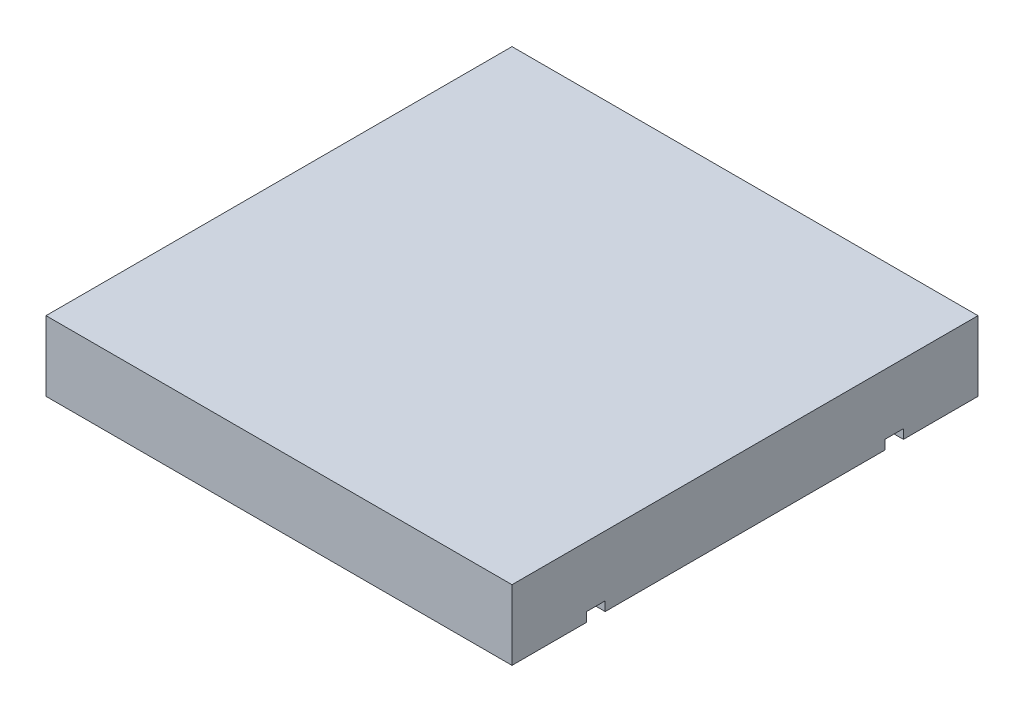
ISO-10303-21;
HEADER;
FILE_DESCRIPTION(('STEP AP214'),'2;1');
FILE_NAME('part.step','',(''),(''),'','','');
FILE_SCHEMA(('AUTOMOTIVE_DESIGN { 1 0 10303 214 1 1 1 1 }'));
ENDSEC;
DATA;
#1=APPLICATION_CONTEXT('core data for automotive mechanical design processes');
#2=APPLICATION_PROTOCOL_DEFINITION('international standard','automotive_design',2000,#1);
#3=PRODUCT_CONTEXT('',#1,'mechanical');
#4=PRODUCT('Part','Part','',(#3));
#5=PRODUCT_RELATED_PRODUCT_CATEGORY('part','',(#4));
#6=PRODUCT_DEFINITION_FORMATION('','',#4);
#7=PRODUCT_DEFINITION_CONTEXT('part definition',#1,'design');
#8=PRODUCT_DEFINITION('design','',#6,#7);
#9=PRODUCT_DEFINITION_SHAPE('','',#8);
#10=(LENGTH_UNIT() NAMED_UNIT(*) SI_UNIT(.MILLI.,.METRE.));
#11=(NAMED_UNIT(*) PLANE_ANGLE_UNIT() SI_UNIT($,.RADIAN.));
#12=(NAMED_UNIT(*) SI_UNIT($,.STERADIAN.) SOLID_ANGLE_UNIT());
#13=UNCERTAINTY_MEASURE_WITH_UNIT(LENGTH_MEASURE(1.E-05),#10,'distance_accuracy_value','');
#14=(GEOMETRIC_REPRESENTATION_CONTEXT(3) GLOBAL_UNCERTAINTY_ASSIGNED_CONTEXT((#13)) GLOBAL_UNIT_ASSIGNED_CONTEXT((#10,
#11,#12)) REPRESENTATION_CONTEXT('',''));
#15=CARTESIAN_POINT('',(0.,0.,0.));
#16=DIRECTION('',(0.,0.,1.));
#17=DIRECTION('',(1.,0.,0.));
#18=AXIS2_PLACEMENT_3D('',#15,#16,#17);
#19=CARTESIAN_POINT('',(0.,0.,0.));
#20=DIRECTION('',(0.,-1.,0.));
#21=DIRECTION('',(0.,0.,-1.));
#22=AXIS2_PLACEMENT_3D('',#19,#20,#21);
#23=PLANE('',#22);
#24=DIRECTION('',(-1.,0.,0.));
#25=VECTOR('',#24,1.);
#26=CARTESIAN_POINT('',(0.,0.,-300.));
#27=LINE('',#26,#25);
#28=CARTESIAN_POINT('',(500.,0.,-300.));
#29=VERTEX_POINT('',#28);
#30=CARTESIAN_POINT('',(-500.,0.,-300.));
#31=VERTEX_POINT('',#30);
#32=EDGE_CURVE('E11',#29,#31,#27,.T.);
#33=ORIENTED_EDGE('',*,*,#32,.F.);
#34=DIRECTION('',(0.,0.,-1.));
#35=VECTOR('',#34,1.);
#36=CARTESIAN_POINT('',(500.,0.,500.));
#37=LINE('',#36,#35);
#38=CARTESIAN_POINT('',(500.,0.,300.));
#39=VERTEX_POINT('',#38);
#40=EDGE_CURVE('E147',#39,#29,#37,.T.);
#41=ORIENTED_EDGE('',*,*,#40,.F.);
#42=DIRECTION('',(1.,0.,0.));
#43=VECTOR('',#42,1.);
#44=CARTESIAN_POINT('',(0.,0.,300.));
#45=LINE('',#44,#43);
#46=CARTESIAN_POINT('',(-500.,0.,300.));
#47=VERTEX_POINT('',#46);
#48=EDGE_CURVE('E209',#47,#39,#45,.T.);
#49=ORIENTED_EDGE('',*,*,#48,.F.);
#50=DIRECTION('',(0.,0.,1.));
#51=VECTOR('',#50,1.);
#52=CARTESIAN_POINT('',(-500.,0.,500.));
#53=LINE('',#52,#51);
#54=EDGE_CURVE('E58',#31,#47,#53,.T.);
#55=ORIENTED_EDGE('',*,*,#54,.F.);
#56=EDGE_LOOP('',(#33,#41,#49,#55));
#57=FACE_BOUND('',#56,.T.);
#58=ADVANCED_FACE('F35',(#57),#23,.T.);
#59=DIRECTION('',(-1.,0.,0.));
#60=VECTOR('',#59,1.);
#61=CARTESIAN_POINT('',(0.,0.,340.));
#62=LINE('',#61,#60);
#63=CARTESIAN_POINT('',(500.,0.,340.));
#64=VERTEX_POINT('',#63);
#65=CARTESIAN_POINT('',(-500.,0.,340.));
#66=VERTEX_POINT('',#65);
#67=EDGE_CURVE('E211',#64,#66,#62,.T.);
#68=ORIENTED_EDGE('',*,*,#67,.F.);
#69=CARTESIAN_POINT('',(500.,0.,500.));
#70=VERTEX_POINT('',#69);
#71=EDGE_CURVE('E188',#70,#64,#37,.T.);
#72=ORIENTED_EDGE('',*,*,#71,.F.);
#73=DIRECTION('',(1.,0.,0.));
#74=VECTOR('',#73,1.);
#75=CARTESIAN_POINT('',(-500.,0.,500.));
#76=LINE('',#75,#74);
#77=CARTESIAN_POINT('',(-500.,0.,500.));
#78=VERTEX_POINT('',#77);
#79=EDGE_CURVE('E181',#78,#70,#76,.T.);
#80=ORIENTED_EDGE('',*,*,#79,.F.);
#81=EDGE_CURVE('E193',#66,#78,#53,.T.);
#82=ORIENTED_EDGE('',*,*,#81,.F.);
#83=EDGE_LOOP('',(#68,#72,#80,#82));
#84=FACE_BOUND('',#83,.T.);
#85=ADVANCED_FACE('F236',(#84),#23,.T.);
#86=CARTESIAN_POINT('',(500.,150.,500.));
#87=DIRECTION('',(-1.,0.,0.));
#88=DIRECTION('',(0.,0.,1.));
#89=AXIS2_PLACEMENT_3D('',#86,#87,#88);
#90=PLANE('',#89);
#91=ORIENTED_EDGE('',*,*,#40,.T.);
#92=DIRECTION('',(0.,1.,0.));
#93=VECTOR('',#92,1.);
#94=CARTESIAN_POINT('',(500.,-20.,-300.));
#95=LINE('',#94,#93);
#96=CARTESIAN_POINT('',(500.,20.,-300.));
#97=VERTEX_POINT('',#96);
#98=EDGE_CURVE('E128',#29,#97,#95,.T.);
#99=ORIENTED_EDGE('',*,*,#98,.T.);
#100=DIRECTION('',(0.,0.,-1.));
#101=VECTOR('',#100,1.);
#102=CARTESIAN_POINT('',(500.,20.,-300.));
#103=LINE('',#102,#101);
#104=CARTESIAN_POINT('',(500.,20.,-340.));
#105=VERTEX_POINT('',#104);
#106=EDGE_CURVE('E138',#97,#105,#103,.T.);
#107=ORIENTED_EDGE('',*,*,#106,.T.);
#108=DIRECTION('',(0.,-1.,0.));
#109=VECTOR('',#108,1.);
#110=CARTESIAN_POINT('',(500.,-20.,-340.));
#111=LINE('',#110,#109);
#112=CARTESIAN_POINT('',(500.,0.,-340.));
#113=VERTEX_POINT('',#112);
#114=EDGE_CURVE('E135',#105,#113,#111,.T.);
#115=ORIENTED_EDGE('',*,*,#114,.T.);
#116=CARTESIAN_POINT('',(500.,0.,-500.));
#117=VERTEX_POINT('',#116);
#118=EDGE_CURVE('E174',#113,#117,#37,.T.);
#119=ORIENTED_EDGE('',*,*,#118,.T.);
#120=DIRECTION('',(0.,-1.,0.));
#121=VECTOR('',#120,1.);
#122=CARTESIAN_POINT('',(500.,150.,-500.));
#123=LINE('',#122,#121);
#124=CARTESIAN_POINT('',(500.,150.,-500.));
#125=VERTEX_POINT('',#124);
#126=EDGE_CURVE('E206',#125,#117,#123,.T.);
#127=ORIENTED_EDGE('',*,*,#126,.F.);
#128=DIRECTION('',(0.,0.,-1.));
#129=VECTOR('',#128,1.);
#130=CARTESIAN_POINT('',(500.,150.,500.));
#131=LINE('',#130,#129);
#132=CARTESIAN_POINT('',(500.,150.,500.));
#133=VERTEX_POINT('',#132);
#134=EDGE_CURVE('E177',#133,#125,#131,.T.);
#135=ORIENTED_EDGE('',*,*,#134,.F.);
#136=DIRECTION('',(0.,-1.,0.));
#137=VECTOR('',#136,1.);
#138=CARTESIAN_POINT('',(500.,150.,500.));
#139=LINE('',#138,#137);
#140=EDGE_CURVE('E187',#133,#70,#139,.T.);
#141=ORIENTED_EDGE('',*,*,#140,.T.);
#142=ORIENTED_EDGE('',*,*,#71,.T.);
#143=DIRECTION('',(0.,1.,0.));
#144=VECTOR('',#143,1.);
#145=CARTESIAN_POINT('',(500.,-20.,340.));
#146=LINE('',#145,#144);
#147=CARTESIAN_POINT('',(500.,20.,340.));
#148=VERTEX_POINT('',#147);
#149=EDGE_CURVE('E157',#64,#148,#146,.T.);
#150=ORIENTED_EDGE('',*,*,#149,.T.);
#151=DIRECTION('',(0.,0.,-1.));
#152=VECTOR('',#151,1.);
#153=CARTESIAN_POINT('',(500.,20.,300.));
#154=LINE('',#153,#152);
#155=CARTESIAN_POINT('',(500.,20.,300.));
#156=VERTEX_POINT('',#155);
#157=EDGE_CURVE('E160',#148,#156,#154,.T.);
#158=ORIENTED_EDGE('',*,*,#157,.T.);
#159=DIRECTION('',(0.,-1.,0.));
#160=VECTOR('',#159,1.);
#161=CARTESIAN_POINT('',(500.,-20.,300.));
#162=LINE('',#161,#160);
#163=EDGE_CURVE('E164',#156,#39,#162,.T.);
#164=ORIENTED_EDGE('',*,*,#163,.T.);
#165=EDGE_LOOP('',(#91,#99,#107,#115,#119,#127,#135,#141,#142,#150,#158,#164));
#166=FACE_BOUND('',#165,.T.);
#167=ADVANCED_FACE('F37',(#166),#90,.F.);
#168=CARTESIAN_POINT('',(-500.,150.,-500.));
#169=DIRECTION('',(0.,0.,1.));
#170=DIRECTION('',(1.,0.,0.));
#171=AXIS2_PLACEMENT_3D('',#168,#169,#170);
#172=PLANE('',#171);
#173=DIRECTION('',(-1.,0.,0.));
#174=VECTOR('',#173,1.);
#175=CARTESIAN_POINT('',(-500.,0.,-500.));
#176=LINE('',#175,#174);
#177=CARTESIAN_POINT('',(-500.,0.,-500.));
#178=VERTEX_POINT('',#177);
#179=EDGE_CURVE('E191',#117,#178,#176,.T.);
#180=ORIENTED_EDGE('',*,*,#179,.T.);
#181=DIRECTION('',(0.,-1.,0.));
#182=VECTOR('',#181,1.);
#183=CARTESIAN_POINT('',(-500.,150.,-500.));
#184=LINE('',#183,#182);
#185=CARTESIAN_POINT('',(-500.,150.,-500.));
#186=VERTEX_POINT('',#185);
#187=EDGE_CURVE('E203',#186,#178,#184,.T.);
#188=ORIENTED_EDGE('',*,*,#187,.F.);
#189=DIRECTION('',(-1.,0.,0.));
#190=VECTOR('',#189,1.);
#191=CARTESIAN_POINT('',(-500.,150.,-500.));
#192=LINE('',#191,#190);
#193=EDGE_CURVE('E180',#125,#186,#192,.T.);
#194=ORIENTED_EDGE('',*,*,#193,.F.);
#195=ORIENTED_EDGE('',*,*,#126,.T.);
#196=EDGE_LOOP('',(#180,#188,#194,#195));
#197=FACE_BOUND('',#196,.T.);
#198=ADVANCED_FACE('F221',(#197),#172,.F.);
#199=CARTESIAN_POINT('',(-500.,150.,500.));
#200=DIRECTION('',(1.,0.,0.));
#201=DIRECTION('',(0.,0.,-1.));
#202=AXIS2_PLACEMENT_3D('',#199,#200,#201);
#203=PLANE('',#202);
#204=DIRECTION('',(0.,0.,-1.));
#205=VECTOR('',#204,1.);
#206=CARTESIAN_POINT('',(-500.,20.,-300.));
#207=LINE('',#206,#205);
#208=CARTESIAN_POINT('',(-500.,20.,-300.));
#209=VERTEX_POINT('',#208);
#210=CARTESIAN_POINT('',(-500.,20.,-340.));
#211=VERTEX_POINT('',#210);
#212=EDGE_CURVE('E149',#209,#211,#207,.T.);
#213=ORIENTED_EDGE('',*,*,#212,.F.);
#214=DIRECTION('',(0.,1.,0.));
#215=VECTOR('',#214,1.);
#216=CARTESIAN_POINT('',(-500.,-20.,-300.));
#217=LINE('',#216,#215);
#218=EDGE_CURVE('E130',#31,#209,#217,.T.);
#219=ORIENTED_EDGE('',*,*,#218,.F.);
#220=ORIENTED_EDGE('',*,*,#54,.T.);
#221=DIRECTION('',(0.,-1.,0.));
#222=VECTOR('',#221,1.);
#223=CARTESIAN_POINT('',(-500.,-20.,300.));
#224=LINE('',#223,#222);
#225=CARTESIAN_POINT('',(-500.,20.,300.));
#226=VERTEX_POINT('',#225);
#227=EDGE_CURVE('E161',#226,#47,#224,.T.);
#228=ORIENTED_EDGE('',*,*,#227,.F.);
#229=DIRECTION('',(0.,0.,-1.));
#230=VECTOR('',#229,1.);
#231=CARTESIAN_POINT('',(-500.,20.,300.));
#232=LINE('',#231,#230);
#233=CARTESIAN_POINT('',(-500.,20.,340.));
#234=VERTEX_POINT('',#233);
#235=EDGE_CURVE('E168',#234,#226,#232,.T.);
#236=ORIENTED_EDGE('',*,*,#235,.F.);
#237=DIRECTION('',(0.,1.,0.));
#238=VECTOR('',#237,1.);
#239=CARTESIAN_POINT('',(-500.,-20.,340.));
#240=LINE('',#239,#238);
#241=EDGE_CURVE('E155',#66,#234,#240,.T.);
#242=ORIENTED_EDGE('',*,*,#241,.F.);
#243=ORIENTED_EDGE('',*,*,#81,.T.);
#244=DIRECTION('',(0.,-1.,0.));
#245=VECTOR('',#244,1.);
#246=CARTESIAN_POINT('',(-500.,150.,500.));
#247=LINE('',#246,#245);
#248=CARTESIAN_POINT('',(-500.,150.,500.));
#249=VERTEX_POINT('',#248);
#250=EDGE_CURVE('E200',#249,#78,#247,.T.);
#251=ORIENTED_EDGE('',*,*,#250,.F.);
#252=DIRECTION('',(0.,0.,1.));
#253=VECTOR('',#252,1.);
#254=CARTESIAN_POINT('',(-500.,150.,500.));
#255=LINE('',#254,#253);
#256=EDGE_CURVE('E183',#186,#249,#255,.T.);
#257=ORIENTED_EDGE('',*,*,#256,.F.);
#258=ORIENTED_EDGE('',*,*,#187,.T.);
#259=CARTESIAN_POINT('',(-500.,0.,-340.));
#260=VERTEX_POINT('',#259);
#261=EDGE_CURVE('E194',#178,#260,#53,.T.);
#262=ORIENTED_EDGE('',*,*,#261,.T.);
#263=DIRECTION('',(0.,-1.,0.));
#264=VECTOR('',#263,1.);
#265=CARTESIAN_POINT('',(-500.,-20.,-340.));
#266=LINE('',#265,#264);
#267=EDGE_CURVE('E50',#211,#260,#266,.T.);
#268=ORIENTED_EDGE('',*,*,#267,.F.);
#269=EDGE_LOOP('',(#213,#219,#220,#228,#236,#242,#243,#251,#257,#258,#262,#268));
#270=FACE_BOUND('',#269,.T.);
#271=ADVANCED_FACE('F249',(#270),#203,.F.);
#272=CARTESIAN_POINT('',(-500.,150.,500.));
#273=DIRECTION('',(0.,0.,-1.));
#274=DIRECTION('',(-1.,0.,0.));
#275=AXIS2_PLACEMENT_3D('',#272,#273,#274);
#276=PLANE('',#275);
#277=ORIENTED_EDGE('',*,*,#79,.T.);
#278=ORIENTED_EDGE('',*,*,#140,.F.);
#279=DIRECTION('',(1.,0.,0.));
#280=VECTOR('',#279,1.);
#281=CARTESIAN_POINT('',(-500.,150.,500.));
#282=LINE('',#281,#280);
#283=EDGE_CURVE('E185',#249,#133,#282,.T.);
#284=ORIENTED_EDGE('',*,*,#283,.F.);
#285=ORIENTED_EDGE('',*,*,#250,.T.);
#286=EDGE_LOOP('',(#277,#278,#284,#285));
#287=FACE_BOUND('',#286,.T.);
#288=ADVANCED_FACE('F231',(#287),#276,.F.);
#289=CARTESIAN_POINT('',(0.,150.,0.));
#290=DIRECTION('',(0.,-1.,0.));
#291=DIRECTION('',(0.,0.,-1.));
#292=AXIS2_PLACEMENT_3D('',#289,#290,#291);
#293=PLANE('',#292);
#294=ORIENTED_EDGE('',*,*,#134,.T.);
#295=ORIENTED_EDGE('',*,*,#193,.T.);
#296=ORIENTED_EDGE('',*,*,#256,.T.);
#297=ORIENTED_EDGE('',*,*,#283,.T.);
#298=EDGE_LOOP('',(#294,#295,#296,#297));
#299=FACE_BOUND('',#298,.T.);
#300=ADVANCED_FACE('F226',(#299),#293,.F.);
#301=DIRECTION('',(1.,0.,0.));
#302=VECTOR('',#301,1.);
#303=CARTESIAN_POINT('',(0.,0.,-340.));
#304=LINE('',#303,#302);
#305=EDGE_CURVE('E43',#260,#113,#304,.T.);
#306=ORIENTED_EDGE('',*,*,#305,.F.);
#307=ORIENTED_EDGE('',*,*,#261,.F.);
#308=ORIENTED_EDGE('',*,*,#179,.F.);
#309=ORIENTED_EDGE('',*,*,#118,.F.);
#310=EDGE_LOOP('',(#306,#307,#308,#309));
#311=FACE_BOUND('',#310,.T.);
#312=ADVANCED_FACE('F218',(#311),#23,.T.);
#313=CARTESIAN_POINT('',(500.,-20.,340.));
#314=DIRECTION('',(0.,0.,1.));
#315=DIRECTION('',(1.,0.,0.));
#316=AXIS2_PLACEMENT_3D('',#313,#314,#315);
#317=PLANE('',#316);
#318=ORIENTED_EDGE('',*,*,#67,.T.);
#319=ORIENTED_EDGE('',*,*,#241,.T.);
#320=DIRECTION('',(-1.,0.,0.));
#321=VECTOR('',#320,1.);
#322=CARTESIAN_POINT('',(500.,20.,340.));
#323=LINE('',#322,#321);
#324=EDGE_CURVE('E166',#148,#234,#323,.T.);
#325=ORIENTED_EDGE('',*,*,#324,.F.);
#326=ORIENTED_EDGE('',*,*,#149,.F.);
#327=EDGE_LOOP('',(#318,#319,#325,#326));
#328=FACE_BOUND('',#327,.T.);
#329=ADVANCED_FACE('F239',(#328),#317,.F.);
#330=CARTESIAN_POINT('',(500.,-20.,300.));
#331=DIRECTION('',(0.,0.,-1.));
#332=DIRECTION('',(-1.,0.,0.));
#333=AXIS2_PLACEMENT_3D('',#330,#331,#332);
#334=PLANE('',#333);
#335=ORIENTED_EDGE('',*,*,#48,.T.);
#336=ORIENTED_EDGE('',*,*,#163,.F.);
#337=DIRECTION('',(-1.,0.,0.));
#338=VECTOR('',#337,1.);
#339=CARTESIAN_POINT('',(500.,20.,300.));
#340=LINE('',#339,#338);
#341=EDGE_CURVE('E172',#156,#226,#340,.T.);
#342=ORIENTED_EDGE('',*,*,#341,.T.);
#343=ORIENTED_EDGE('',*,*,#227,.T.);
#344=EDGE_LOOP('',(#335,#336,#342,#343));
#345=FACE_BOUND('',#344,.T.);
#346=ADVANCED_FACE('F246',(#345),#334,.F.);
#347=CARTESIAN_POINT('',(500.,20.,300.));
#348=DIRECTION('',(0.,1.,0.));
#349=DIRECTION('',(0.,0.,1.));
#350=AXIS2_PLACEMENT_3D('',#347,#348,#349);
#351=PLANE('',#350);
#352=ORIENTED_EDGE('',*,*,#235,.T.);
#353=ORIENTED_EDGE('',*,*,#341,.F.);
#354=ORIENTED_EDGE('',*,*,#157,.F.);
#355=ORIENTED_EDGE('',*,*,#324,.T.);
#356=EDGE_LOOP('',(#352,#353,#354,#355));
#357=FACE_BOUND('',#356,.T.);
#358=ADVANCED_FACE('F243',(#357),#351,.F.);
#359=CARTESIAN_POINT('',(500.,-20.,-300.));
#360=DIRECTION('',(0.,0.,1.));
#361=DIRECTION('',(1.,0.,0.));
#362=AXIS2_PLACEMENT_3D('',#359,#360,#361);
#363=PLANE('',#362);
#364=ORIENTED_EDGE('',*,*,#32,.T.);
#365=ORIENTED_EDGE('',*,*,#218,.T.);
#366=DIRECTION('',(-1.,0.,0.));
#367=VECTOR('',#366,1.);
#368=CARTESIAN_POINT('',(500.,20.,-300.));
#369=LINE('',#368,#367);
#370=EDGE_CURVE('E124',#97,#209,#369,.T.);
#371=ORIENTED_EDGE('',*,*,#370,.F.);
#372=ORIENTED_EDGE('',*,*,#98,.F.);
#373=EDGE_LOOP('',(#364,#365,#371,#372));
#374=FACE_BOUND('',#373,.T.);
#375=ADVANCED_FACE('F126',(#374),#363,.F.);
#376=CARTESIAN_POINT('',(500.,-20.,-340.));
#377=DIRECTION('',(0.,0.,-1.));
#378=DIRECTION('',(-1.,0.,0.));
#379=AXIS2_PLACEMENT_3D('',#376,#377,#378);
#380=PLANE('',#379);
#381=ORIENTED_EDGE('',*,*,#305,.T.);
#382=ORIENTED_EDGE('',*,*,#114,.F.);
#383=DIRECTION('',(-1.,0.,0.));
#384=VECTOR('',#383,1.);
#385=CARTESIAN_POINT('',(500.,20.,-340.));
#386=LINE('',#385,#384);
#387=EDGE_CURVE('E134',#105,#211,#386,.T.);
#388=ORIENTED_EDGE('',*,*,#387,.T.);
#389=ORIENTED_EDGE('',*,*,#267,.T.);
#390=EDGE_LOOP('',(#381,#382,#388,#389));
#391=FACE_BOUND('',#390,.T.);
#392=ADVANCED_FACE('F212',(#391),#380,.F.);
#393=CARTESIAN_POINT('',(500.,20.,-300.));
#394=DIRECTION('',(0.,1.,0.));
#395=DIRECTION('',(0.,0.,1.));
#396=AXIS2_PLACEMENT_3D('',#393,#394,#395);
#397=PLANE('',#396);
#398=ORIENTED_EDGE('',*,*,#212,.T.);
#399=ORIENTED_EDGE('',*,*,#387,.F.);
#400=ORIENTED_EDGE('',*,*,#106,.F.);
#401=ORIENTED_EDGE('',*,*,#370,.T.);
#402=EDGE_LOOP('',(#398,#399,#400,#401));
#403=FACE_BOUND('',#402,.T.);
#404=ADVANCED_FACE('F139',(#403),#397,.F.);
#405=CLOSED_SHELL('',(#58,#85,#167,#198,#271,#288,#300,#312,#329,#346,#358,#375,#392,#404));
#406=MANIFOLD_SOLID_BREP('B2',#405);
#407=ADVANCED_BREP_SHAPE_REPRESENTATION('',(#18,#406),#14);
#408=SHAPE_DEFINITION_REPRESENTATION(#9,#407);
ENDSEC;
END-ISO-10303-21;
